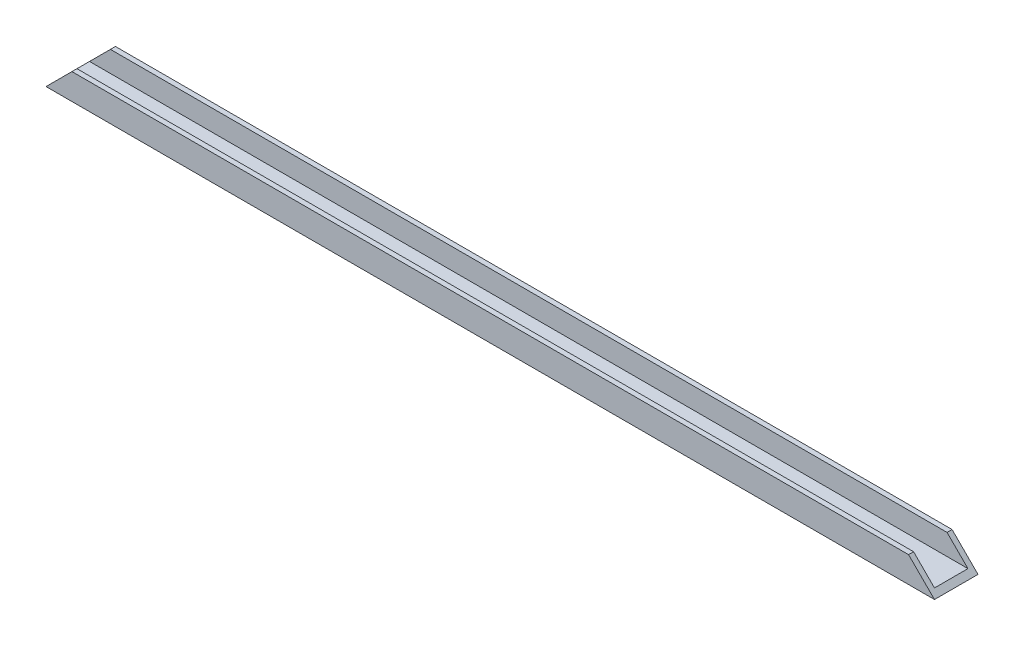
ISO-10303-21;
HEADER;
FILE_DESCRIPTION(('STEP AP214'),'2;1');
FILE_NAME('part.step','',(''),(''),'','','');
FILE_SCHEMA(('AUTOMOTIVE_DESIGN { 1 0 10303 214 1 1 1 1 }'));
ENDSEC;
DATA;
#1=APPLICATION_CONTEXT('core data for automotive mechanical design processes');
#2=APPLICATION_PROTOCOL_DEFINITION('international standard','automotive_design',2000,#1);
#3=PRODUCT_CONTEXT('',#1,'mechanical');
#4=PRODUCT('Part','Part','',(#3));
#5=PRODUCT_RELATED_PRODUCT_CATEGORY('part','',(#4));
#6=PRODUCT_DEFINITION_FORMATION('','',#4);
#7=PRODUCT_DEFINITION_CONTEXT('part definition',#1,'design');
#8=PRODUCT_DEFINITION('design','',#6,#7);
#9=PRODUCT_DEFINITION_SHAPE('','',#8);
#10=(LENGTH_UNIT() NAMED_UNIT(*) SI_UNIT(.MILLI.,.METRE.));
#11=(NAMED_UNIT(*) PLANE_ANGLE_UNIT() SI_UNIT($,.RADIAN.));
#12=(NAMED_UNIT(*) SI_UNIT($,.STERADIAN.) SOLID_ANGLE_UNIT());
#13=UNCERTAINTY_MEASURE_WITH_UNIT(LENGTH_MEASURE(1.E-05),#10,'distance_accuracy_value','');
#14=(GEOMETRIC_REPRESENTATION_CONTEXT(3) GLOBAL_UNCERTAINTY_ASSIGNED_CONTEXT((#13)) GLOBAL_UNIT_ASSIGNED_CONTEXT((#10,
#11,#12)) REPRESENTATION_CONTEXT('',''));
#15=CARTESIAN_POINT('',(0.,0.,0.));
#16=DIRECTION('',(0.,0.,1.));
#17=DIRECTION('',(1.,0.,0.));
#18=AXIS2_PLACEMENT_3D('',#15,#16,#17);
#19=CARTESIAN_POINT('',(106.2,5.,5.2));
#20=DIRECTION('',(0.,-1.,0.));
#21=DIRECTION('',(0.,0.,-1.));
#22=AXIS2_PLACEMENT_3D('',#19,#20,#21);
#23=PLANE('',#22);
#24=DIRECTION('',(-1.,0.,0.));
#25=VECTOR('',#24,1.);
#26=CARTESIAN_POINT('',(106.2,5.,4.));
#27=LINE('',#26,#25);
#28=CARTESIAN_POINT('',(100.,5.00000000000002,4.));
#29=VERTEX_POINT('',#28);
#30=CARTESIAN_POINT('',(-100.,5.,4.));
#31=VERTEX_POINT('',#30);
#32=EDGE_CURVE('E165',#29,#31,#27,.T.);
#33=ORIENTED_EDGE('',*,*,#32,.T.);
#34=DIRECTION('',(0.,0.,1.));
#35=VECTOR('',#34,1.);
#36=CARTESIAN_POINT('',(-100.,5.,-5.2));
#37=LINE('',#36,#35);
#38=CARTESIAN_POINT('',(-100.,5.,5.2));
#39=VERTEX_POINT('',#38);
#40=EDGE_CURVE('E110',#31,#39,#37,.T.);
#41=ORIENTED_EDGE('',*,*,#40,.T.);
#42=DIRECTION('',(-1.,0.,0.));
#43=VECTOR('',#42,1.);
#44=CARTESIAN_POINT('',(106.2,5.,5.2));
#45=LINE('',#44,#43);
#46=CARTESIAN_POINT('',(100.,5.00000000000002,5.2));
#47=VERTEX_POINT('',#46);
#48=EDGE_CURVE('E11',#47,#39,#45,.T.);
#49=ORIENTED_EDGE('',*,*,#48,.F.);
#50=DIRECTION('',(0.,0.,1.));
#51=VECTOR('',#50,1.);
#52=CARTESIAN_POINT('',(100.,5.00000000000002,-5.2));
#53=LINE('',#52,#51);
#54=EDGE_CURVE('E146',#29,#47,#53,.T.);
#55=ORIENTED_EDGE('',*,*,#54,.F.);
#56=EDGE_LOOP('',(#33,#41,#49,#55));
#57=FACE_BOUND('',#56,.T.);
#58=ADVANCED_FACE('F39',(#57),#23,.F.);
#59=CARTESIAN_POINT('',(106.2,5.,5.2));
#60=DIRECTION('',(0.,0.,-1.));
#61=DIRECTION('',(0.,1.,0.));
#62=AXIS2_PLACEMENT_3D('',#59,#60,#61);
#63=PLANE('',#62);
#64=ORIENTED_EDGE('',*,*,#48,.T.);
#65=DIRECTION('',(0.707106781186542,0.707106781186553,0.));
#66=VECTOR('',#65,1.);
#67=CARTESIAN_POINT('',(-106.2,-1.2,5.2));
#68=LINE('',#67,#66);
#69=CARTESIAN_POINT('',(-106.2,-1.2,5.2));
#70=VERTEX_POINT('',#69);
#71=EDGE_CURVE('E120',#70,#39,#68,.T.);
#72=ORIENTED_EDGE('',*,*,#71,.F.);
#73=DIRECTION('',(-1.,0.,0.));
#74=VECTOR('',#73,1.);
#75=CARTESIAN_POINT('',(106.2,-1.2,5.2));
#76=LINE('',#75,#74);
#77=CARTESIAN_POINT('',(106.2,-1.2,5.2));
#78=VERTEX_POINT('',#77);
#79=EDGE_CURVE('E47',#78,#70,#76,.T.);
#80=ORIENTED_EDGE('',*,*,#79,.F.);
#81=DIRECTION('',(0.707106781186542,-0.707106781186553,0.));
#82=VECTOR('',#81,1.);
#83=CARTESIAN_POINT('',(106.2,-1.19999999999997,5.2));
#84=LINE('',#83,#82);
#85=EDGE_CURVE('E53',#47,#78,#84,.T.);
#86=ORIENTED_EDGE('',*,*,#85,.F.);
#87=EDGE_LOOP('',(#64,#72,#80,#86));
#88=FACE_BOUND('',#87,.T.);
#89=ADVANCED_FACE('F139',(#88),#63,.F.);
#90=CARTESIAN_POINT('',(106.2,-1.2,5.2));
#91=DIRECTION('',(0.,1.,0.));
#92=DIRECTION('',(0.,0.,1.));
#93=AXIS2_PLACEMENT_3D('',#90,#91,#92);
#94=PLANE('',#93);
#95=DIRECTION('',(0.,0.,-1.));
#96=VECTOR('',#95,1.);
#97=CARTESIAN_POINT('',(-106.2,-1.2,5.2));
#98=LINE('',#97,#96);
#99=CARTESIAN_POINT('',(-106.2,-1.2,-5.2));
#100=VERTEX_POINT('',#99);
#101=EDGE_CURVE('E135',#70,#100,#98,.T.);
#102=ORIENTED_EDGE('',*,*,#101,.T.);
#103=DIRECTION('',(-1.,0.,0.));
#104=VECTOR('',#103,1.);
#105=CARTESIAN_POINT('',(106.2,-1.2,-5.2));
#106=LINE('',#105,#104);
#107=CARTESIAN_POINT('',(106.2,-1.19999999999997,-5.2));
#108=VERTEX_POINT('',#107);
#109=EDGE_CURVE('E119',#108,#100,#106,.T.);
#110=ORIENTED_EDGE('',*,*,#109,.F.);
#111=DIRECTION('',(0.,0.,-1.));
#112=VECTOR('',#111,1.);
#113=CARTESIAN_POINT('',(106.2,-1.2,5.2));
#114=LINE('',#113,#112);
#115=EDGE_CURVE('E136',#78,#108,#114,.T.);
#116=ORIENTED_EDGE('',*,*,#115,.F.);
#117=ORIENTED_EDGE('',*,*,#79,.T.);
#118=EDGE_LOOP('',(#102,#110,#116,#117));
#119=FACE_BOUND('',#118,.T.);
#120=ADVANCED_FACE('F134',(#119),#94,.F.);
#121=CARTESIAN_POINT('',(106.2,-1.2,-5.2));
#122=DIRECTION('',(0.,0.,1.));
#123=DIRECTION('',(1.,0.,0.));
#124=AXIS2_PLACEMENT_3D('',#121,#122,#123);
#125=PLANE('',#124);
#126=ORIENTED_EDGE('',*,*,#109,.T.);
#127=DIRECTION('',(0.707106781186542,0.707106781186553,0.));
#128=VECTOR('',#127,1.);
#129=CARTESIAN_POINT('',(-106.2,-1.2,-5.2));
#130=LINE('',#129,#128);
#131=CARTESIAN_POINT('',(-100.,5.,-5.2));
#132=VERTEX_POINT('',#131);
#133=EDGE_CURVE('E101',#100,#132,#130,.T.);
#134=ORIENTED_EDGE('',*,*,#133,.T.);
#135=DIRECTION('',(-1.,0.,0.));
#136=VECTOR('',#135,1.);
#137=CARTESIAN_POINT('',(106.2,5.,-5.2));
#138=LINE('',#137,#136);
#139=CARTESIAN_POINT('',(100.,5.00000000000002,-5.2));
#140=VERTEX_POINT('',#139);
#141=EDGE_CURVE('E117',#140,#132,#138,.T.);
#142=ORIENTED_EDGE('',*,*,#141,.F.);
#143=DIRECTION('',(0.707106781186542,-0.707106781186553,0.));
#144=VECTOR('',#143,1.);
#145=CARTESIAN_POINT('',(106.2,-1.19999999999997,-5.2));
#146=LINE('',#145,#144);
#147=EDGE_CURVE('E143',#140,#108,#146,.T.);
#148=ORIENTED_EDGE('',*,*,#147,.T.);
#149=EDGE_LOOP('',(#126,#134,#142,#148));
#150=FACE_BOUND('',#149,.T.);
#151=ADVANCED_FACE('F115',(#150),#125,.F.);
#152=CARTESIAN_POINT('',(106.2,5.,-4.));
#153=DIRECTION('',(0.,-1.,0.));
#154=DIRECTION('',(0.,0.,-1.));
#155=AXIS2_PLACEMENT_3D('',#152,#153,#154);
#156=PLANE('',#155);
#157=ORIENTED_EDGE('',*,*,#141,.T.);
#158=CARTESIAN_POINT('',(-100.,5.,-4.));
#159=VERTEX_POINT('',#158);
#160=EDGE_CURVE('E98',#132,#159,#37,.T.);
#161=ORIENTED_EDGE('',*,*,#160,.T.);
#162=DIRECTION('',(-1.,0.,0.));
#163=VECTOR('',#162,1.);
#164=CARTESIAN_POINT('',(106.2,5.,-4.));
#165=LINE('',#164,#163);
#166=CARTESIAN_POINT('',(100.,5.00000000000002,-4.));
#167=VERTEX_POINT('',#166);
#168=EDGE_CURVE('E125',#167,#159,#165,.T.);
#169=ORIENTED_EDGE('',*,*,#168,.F.);
#170=EDGE_CURVE('E124',#140,#167,#53,.T.);
#171=ORIENTED_EDGE('',*,*,#170,.F.);
#172=EDGE_LOOP('',(#157,#161,#169,#171));
#173=FACE_BOUND('',#172,.T.);
#174=ADVANCED_FACE('F123',(#173),#156,.F.);
#175=CARTESIAN_POINT('',(106.2,0.,-4.));
#176=DIRECTION('',(0.,0.,-1.));
#177=DIRECTION('',(-1.,0.,0.));
#178=AXIS2_PLACEMENT_3D('',#175,#176,#177);
#179=PLANE('',#178);
#180=ORIENTED_EDGE('',*,*,#168,.T.);
#181=DIRECTION('',(-0.707106781186542,-0.707106781186553,0.));
#182=VECTOR('',#181,1.);
#183=CARTESIAN_POINT('',(0.599999999998269,105.6,-4.));
#184=LINE('',#183,#182);
#185=CARTESIAN_POINT('',(-105.,0.,-4.));
#186=VERTEX_POINT('',#185);
#187=EDGE_CURVE('E104',#159,#186,#184,.T.);
#188=ORIENTED_EDGE('',*,*,#187,.T.);
#189=DIRECTION('',(-1.,0.,0.));
#190=VECTOR('',#189,1.);
#191=CARTESIAN_POINT('',(106.2,0.,-4.));
#192=LINE('',#191,#190);
#193=CARTESIAN_POINT('',(105.,0.,-4.));
#194=VERTEX_POINT('',#193);
#195=EDGE_CURVE('E128',#194,#186,#192,.T.);
#196=ORIENTED_EDGE('',*,*,#195,.F.);
#197=DIRECTION('',(-0.707106781186542,0.707106781186553,0.));
#198=VECTOR('',#197,1.);
#199=CARTESIAN_POINT('',(105.6,-0.599999999999977,-4.));
#200=LINE('',#199,#198);
#201=EDGE_CURVE('E161',#194,#167,#200,.T.);
#202=ORIENTED_EDGE('',*,*,#201,.T.);
#203=EDGE_LOOP('',(#180,#188,#196,#202));
#204=FACE_BOUND('',#203,.T.);
#205=ADVANCED_FACE('F177',(#204),#179,.F.);
#206=CARTESIAN_POINT('',(106.2,0.,4.));
#207=DIRECTION('',(0.,-1.,0.));
#208=DIRECTION('',(0.,0.,-1.));
#209=AXIS2_PLACEMENT_3D('',#206,#207,#208);
#210=PLANE('',#209);
#211=ORIENTED_EDGE('',*,*,#195,.T.);
#212=DIRECTION('',(0.,0.,1.));
#213=VECTOR('',#212,1.);
#214=CARTESIAN_POINT('',(-105.,0.,3.99999999999996));
#215=LINE('',#214,#213);
#216=CARTESIAN_POINT('',(-105.,0.,4.));
#217=VERTEX_POINT('',#216);
#218=EDGE_CURVE('E151',#186,#217,#215,.T.);
#219=ORIENTED_EDGE('',*,*,#218,.T.);
#220=DIRECTION('',(-1.,0.,0.));
#221=VECTOR('',#220,1.);
#222=CARTESIAN_POINT('',(106.2,0.,4.));
#223=LINE('',#222,#221);
#224=CARTESIAN_POINT('',(105.,0.,4.));
#225=VERTEX_POINT('',#224);
#226=EDGE_CURVE('E169',#225,#217,#223,.T.);
#227=ORIENTED_EDGE('',*,*,#226,.F.);
#228=DIRECTION('',(0.,0.,-1.));
#229=VECTOR('',#228,1.);
#230=CARTESIAN_POINT('',(105.,0.,4.));
#231=LINE('',#230,#229);
#232=EDGE_CURVE('E158',#225,#194,#231,.T.);
#233=ORIENTED_EDGE('',*,*,#232,.T.);
#234=EDGE_LOOP('',(#211,#219,#227,#233));
#235=FACE_BOUND('',#234,.T.);
#236=ADVANCED_FACE('F174',(#235),#210,.F.);
#237=CARTESIAN_POINT('',(106.2,5.,4.));
#238=DIRECTION('',(0.,0.,1.));
#239=DIRECTION('',(1.,0.,0.));
#240=AXIS2_PLACEMENT_3D('',#237,#238,#239);
#241=PLANE('',#240);
#242=ORIENTED_EDGE('',*,*,#226,.T.);
#243=DIRECTION('',(0.707106781186542,0.707106781186553,0.));
#244=VECTOR('',#243,1.);
#245=CARTESIAN_POINT('',(3.09999999999827,108.1,4.));
#246=LINE('',#245,#244);
#247=EDGE_CURVE('E109',#217,#31,#246,.T.);
#248=ORIENTED_EDGE('',*,*,#247,.T.);
#249=ORIENTED_EDGE('',*,*,#32,.F.);
#250=DIRECTION('',(0.707106781186542,-0.707106781186553,0.));
#251=VECTOR('',#250,1.);
#252=CARTESIAN_POINT('',(103.1,1.90000000000006,4.));
#253=LINE('',#252,#251);
#254=EDGE_CURVE('E155',#29,#225,#253,.T.);
#255=ORIENTED_EDGE('',*,*,#254,.T.);
#256=EDGE_LOOP('',(#242,#248,#249,#255));
#257=FACE_BOUND('',#256,.T.);
#258=ADVANCED_FACE('F182',(#257),#241,.F.);
#259=CARTESIAN_POINT('',(-106.2,-1.2,-5.2));
#260=DIRECTION('',(0.707106781186553,-0.707106781186542,0.));
#261=DIRECTION('',(0.707106781186542,0.707106781186553,0.));
#262=AXIS2_PLACEMENT_3D('',#259,#260,#261);
#263=PLANE('',#262);
#264=ORIENTED_EDGE('',*,*,#160,.F.);
#265=ORIENTED_EDGE('',*,*,#133,.F.);
#266=ORIENTED_EDGE('',*,*,#101,.F.);
#267=ORIENTED_EDGE('',*,*,#71,.T.);
#268=ORIENTED_EDGE('',*,*,#40,.F.);
#269=ORIENTED_EDGE('',*,*,#247,.F.);
#270=ORIENTED_EDGE('',*,*,#218,.F.);
#271=ORIENTED_EDGE('',*,*,#187,.F.);
#272=EDGE_LOOP('',(#264,#265,#266,#267,#268,#269,#270,#271));
#273=FACE_BOUND('',#272,.T.);
#274=ADVANCED_FACE('F100',(#273),#263,.F.);
#275=CARTESIAN_POINT('',(106.2,-1.19999999999997,-5.2));
#276=DIRECTION('',(-0.707106781186553,-0.707106781186542,0.));
#277=DIRECTION('',(0.707106781186542,-0.707106781186553,0.));
#278=AXIS2_PLACEMENT_3D('',#275,#276,#277);
#279=PLANE('',#278);
#280=ORIENTED_EDGE('',*,*,#232,.F.);
#281=ORIENTED_EDGE('',*,*,#254,.F.);
#282=ORIENTED_EDGE('',*,*,#54,.T.);
#283=ORIENTED_EDGE('',*,*,#85,.T.);
#284=ORIENTED_EDGE('',*,*,#115,.T.);
#285=ORIENTED_EDGE('',*,*,#147,.F.);
#286=ORIENTED_EDGE('',*,*,#170,.T.);
#287=ORIENTED_EDGE('',*,*,#201,.F.);
#288=EDGE_LOOP('',(#280,#281,#282,#283,#284,#285,#286,#287));
#289=FACE_BOUND('',#288,.T.);
#290=ADVANCED_FACE('F178',(#289),#279,.F.);
#291=CLOSED_SHELL('',(#58,#89,#120,#151,#174,#205,#236,#258,#274,#290));
#292=MANIFOLD_SOLID_BREP('B2',#291);
#293=ADVANCED_BREP_SHAPE_REPRESENTATION('',(#18,#292),#14);
#294=SHAPE_DEFINITION_REPRESENTATION(#9,#293);
ENDSEC;
END-ISO-10303-21;
